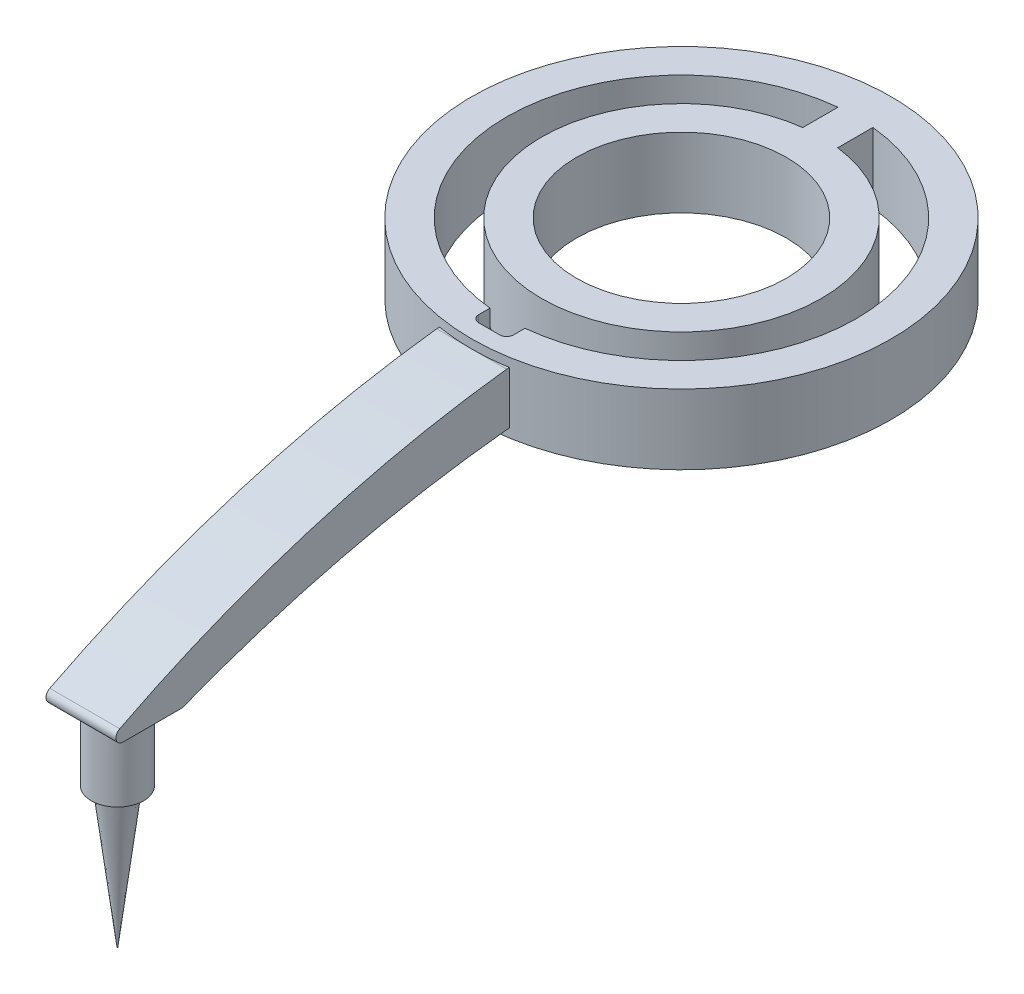
ISO-10303-21;
HEADER;
FILE_DESCRIPTION(('STEP AP214'),'2;1');
FILE_NAME('part.step','',(''),(''),'','','');
FILE_SCHEMA(('AUTOMOTIVE_DESIGN { 1 0 10303 214 1 1 1 1 }'));
ENDSEC;
DATA;
#1=APPLICATION_CONTEXT('core data for automotive mechanical design processes');
#2=APPLICATION_PROTOCOL_DEFINITION('international standard','automotive_design',2000,#1);
#3=PRODUCT_CONTEXT('',#1,'mechanical');
#4=PRODUCT('Part','Part','',(#3));
#5=PRODUCT_RELATED_PRODUCT_CATEGORY('part','',(#4));
#6=PRODUCT_DEFINITION_FORMATION('','',#4);
#7=PRODUCT_DEFINITION_CONTEXT('part definition',#1,'design');
#8=PRODUCT_DEFINITION('design','',#6,#7);
#9=PRODUCT_DEFINITION_SHAPE('','',#8);
#10=(LENGTH_UNIT() NAMED_UNIT(*) SI_UNIT(.MILLI.,.METRE.));
#11=(NAMED_UNIT(*) PLANE_ANGLE_UNIT() SI_UNIT($,.RADIAN.));
#12=(NAMED_UNIT(*) SI_UNIT($,.STERADIAN.) SOLID_ANGLE_UNIT());
#13=UNCERTAINTY_MEASURE_WITH_UNIT(LENGTH_MEASURE(1.E-05),#10,'distance_accuracy_value','');
#14=(GEOMETRIC_REPRESENTATION_CONTEXT(3) GLOBAL_UNCERTAINTY_ASSIGNED_CONTEXT((#13)) GLOBAL_UNIT_ASSIGNED_CONTEXT((#10,
#11,#12)) REPRESENTATION_CONTEXT('',''));
#15=CARTESIAN_POINT('',(0.,0.,0.));
#16=DIRECTION('',(0.,0.,1.));
#17=DIRECTION('',(1.,0.,0.));
#18=AXIS2_PLACEMENT_3D('',#15,#16,#17);
#19=CARTESIAN_POINT('',(0.,10.,0.));
#20=DIRECTION('',(0.,-1.,0.));
#21=DIRECTION('',(0.,0.,-1.));
#22=AXIS2_PLACEMENT_3D('',#19,#20,#21);
#23=CYLINDRICAL_SURFACE('',#22,25.);
#24=CARTESIAN_POINT('',(0.,0.,0.));
#25=DIRECTION('',(0.,1.,0.));
#26=DIRECTION('',(0.,0.,1.));
#27=AXIS2_PLACEMENT_3D('',#24,#25,#26);
#28=CIRCLE('',#27,25.);
#29=CARTESIAN_POINT('',(-2.5,0.,-24.8746859276655));
#30=VERTEX_POINT('',#29);
#31=CARTESIAN_POINT('',(-2.5,0.,24.8746859276655));
#32=VERTEX_POINT('',#31);
#33=EDGE_CURVE('E184',#30,#32,#28,.T.);
#34=ORIENTED_EDGE('',*,*,#33,.F.);
#35=DIRECTION('',(0.,-1.,0.));
#36=VECTOR('',#35,1.);
#37=CARTESIAN_POINT('',(-2.5,10.,-24.8746859276655));
#38=LINE('',#37,#36);
#39=CARTESIAN_POINT('',(-2.5,10.,-24.8746859276655));
#40=VERTEX_POINT('',#39);
#41=EDGE_CURVE('E272',#40,#30,#38,.T.);
#42=ORIENTED_EDGE('',*,*,#41,.F.);
#43=CARTESIAN_POINT('',(0.,10.,0.));
#44=DIRECTION('',(0.,1.,0.));
#45=DIRECTION('',(0.,0.,1.));
#46=AXIS2_PLACEMENT_3D('',#43,#44,#45);
#47=CIRCLE('',#46,25.);
#48=CARTESIAN_POINT('',(-2.5,10.,24.8746859276655));
#49=VERTEX_POINT('',#48);
#50=EDGE_CURVE('E194',#40,#49,#47,.T.);
#51=ORIENTED_EDGE('',*,*,#50,.T.);
#52=DIRECTION('',(0.,-1.,0.));
#53=VECTOR('',#52,1.);
#54=CARTESIAN_POINT('',(-2.5,10.,24.8746859276655));
#55=LINE('',#54,#53);
#56=EDGE_CURVE('E225',#49,#32,#55,.T.);
#57=ORIENTED_EDGE('',*,*,#56,.T.);
#58=EDGE_LOOP('',(#34,#42,#51,#57));
#59=FACE_BOUND('',#58,.T.);
#60=ADVANCED_FACE('F38',(#59),#23,.F.);
#61=CARTESIAN_POINT('',(-2.5,10.,0.));
#62=DIRECTION('',(1.,0.,0.));
#63=DIRECTION('',(0.,0.,-1.));
#64=AXIS2_PLACEMENT_3D('',#61,#62,#63);
#65=PLANE('',#64);
#66=DIRECTION('',(0.,0.,1.));
#67=VECTOR('',#66,1.);
#68=CARTESIAN_POINT('',(-2.5,0.,0.));
#69=LINE('',#68,#67);
#70=CARTESIAN_POINT('',(-2.5,0.,-19.8431348329844));
#71=VERTEX_POINT('',#70);
#72=EDGE_CURVE('E187',#30,#71,#69,.T.);
#73=ORIENTED_EDGE('',*,*,#72,.T.);
#74=DIRECTION('',(0.,-1.,0.));
#75=VECTOR('',#74,1.);
#76=CARTESIAN_POINT('',(-2.5,10.,-19.8431348329844));
#77=LINE('',#76,#75);
#78=CARTESIAN_POINT('',(-2.5,10.,-19.8431348329844));
#79=VERTEX_POINT('',#78);
#80=EDGE_CURVE('E269',#79,#71,#77,.T.);
#81=ORIENTED_EDGE('',*,*,#80,.F.);
#82=DIRECTION('',(0.,0.,1.));
#83=VECTOR('',#82,1.);
#84=CARTESIAN_POINT('',(-2.5,10.,0.));
#85=LINE('',#84,#83);
#86=EDGE_CURVE('E197',#40,#79,#85,.T.);
#87=ORIENTED_EDGE('',*,*,#86,.F.);
#88=ORIENTED_EDGE('',*,*,#41,.T.);
#89=EDGE_LOOP('',(#73,#81,#87,#88));
#90=FACE_BOUND('',#89,.T.);
#91=ADVANCED_FACE('F40',(#90),#65,.F.);
#92=CARTESIAN_POINT('',(0.,10.,0.));
#93=DIRECTION('',(0.,-1.,0.));
#94=DIRECTION('',(0.,0.,-1.));
#95=AXIS2_PLACEMENT_3D('',#92,#93,#94);
#96=CYLINDRICAL_SURFACE('',#95,20.);
#97=CARTESIAN_POINT('',(0.,0.,0.));
#98=DIRECTION('',(0.,1.,0.));
#99=DIRECTION('',(0.,0.,1.));
#100=AXIS2_PLACEMENT_3D('',#97,#98,#99);
#101=CIRCLE('',#100,20.);
#102=CARTESIAN_POINT('',(2.5,0.,-19.8431348329844));
#103=VERTEX_POINT('',#102);
#104=EDGE_CURVE('E228',#71,#103,#101,.T.);
#105=ORIENTED_EDGE('',*,*,#104,.T.);
#106=DIRECTION('',(0.,-1.,0.));
#107=VECTOR('',#106,1.);
#108=CARTESIAN_POINT('',(2.5,10.,-19.8431348329844));
#109=LINE('',#108,#107);
#110=CARTESIAN_POINT('',(2.5,10.,-19.8431348329844));
#111=VERTEX_POINT('',#110);
#112=EDGE_CURVE('E267',#111,#103,#109,.T.);
#113=ORIENTED_EDGE('',*,*,#112,.F.);
#114=CARTESIAN_POINT('',(0.,10.,0.));
#115=DIRECTION('',(0.,1.,0.));
#116=DIRECTION('',(0.,0.,1.));
#117=AXIS2_PLACEMENT_3D('',#114,#115,#116);
#118=CIRCLE('',#117,20.);
#119=EDGE_CURVE('E201',#79,#111,#118,.T.);
#120=ORIENTED_EDGE('',*,*,#119,.F.);
#121=ORIENTED_EDGE('',*,*,#80,.T.);
#122=EDGE_LOOP('',(#105,#113,#120,#121));
#123=FACE_BOUND('',#122,.T.);
#124=ADVANCED_FACE('F377',(#123),#96,.T.);
#125=CARTESIAN_POINT('',(2.5,10.,0.));
#126=DIRECTION('',(1.,0.,0.));
#127=DIRECTION('',(0.,0.,-1.));
#128=AXIS2_PLACEMENT_3D('',#125,#126,#127);
#129=PLANE('',#128);
#130=DIRECTION('',(0.,0.,1.));
#131=VECTOR('',#130,1.);
#132=CARTESIAN_POINT('',(2.5,0.,0.));
#133=LINE('',#132,#131);
#134=CARTESIAN_POINT('',(2.5,0.,-24.8746859276655));
#135=VERTEX_POINT('',#134);
#136=EDGE_CURVE('E231',#135,#103,#133,.T.);
#137=ORIENTED_EDGE('',*,*,#136,.F.);
#138=DIRECTION('',(0.,-1.,0.));
#139=VECTOR('',#138,1.);
#140=CARTESIAN_POINT('',(2.5,10.,-24.8746859276655));
#141=LINE('',#140,#139);
#142=CARTESIAN_POINT('',(2.5,10.,-24.8746859276655));
#143=VERTEX_POINT('',#142);
#144=EDGE_CURVE('E265',#143,#135,#141,.T.);
#145=ORIENTED_EDGE('',*,*,#144,.F.);
#146=DIRECTION('',(0.,0.,1.));
#147=VECTOR('',#146,1.);
#148=CARTESIAN_POINT('',(2.5,10.,0.));
#149=LINE('',#148,#147);
#150=EDGE_CURVE('E203',#143,#111,#149,.T.);
#151=ORIENTED_EDGE('',*,*,#150,.T.);
#152=ORIENTED_EDGE('',*,*,#112,.T.);
#153=EDGE_LOOP('',(#137,#145,#151,#152));
#154=FACE_BOUND('',#153,.T.);
#155=ADVANCED_FACE('F384',(#154),#129,.T.);
#156=CARTESIAN_POINT('',(2.5,0.,24.8746859276655));
#157=VERTEX_POINT('',#156);
#158=EDGE_CURVE('E189',#157,#135,#28,.T.);
#159=ORIENTED_EDGE('',*,*,#158,.F.);
#160=DIRECTION('',(0.,-1.,0.));
#161=VECTOR('',#160,1.);
#162=CARTESIAN_POINT('',(2.5,10.,24.8746859276655));
#163=LINE('',#162,#161);
#164=CARTESIAN_POINT('',(2.5,10.,24.8746859276655));
#165=VERTEX_POINT('',#164);
#166=EDGE_CURVE('E263',#165,#157,#163,.T.);
#167=ORIENTED_EDGE('',*,*,#166,.F.);
#168=EDGE_CURVE('E199',#165,#143,#47,.T.);
#169=ORIENTED_EDGE('',*,*,#168,.T.);
#170=ORIENTED_EDGE('',*,*,#144,.T.);
#171=EDGE_LOOP('',(#159,#167,#169,#170));
#172=FACE_BOUND('',#171,.T.);
#173=ADVANCED_FACE('F373',(#172),#23,.F.);
#174=CARTESIAN_POINT('',(2.5,10.,0.));
#175=DIRECTION('',(1.,0.,0.));
#176=DIRECTION('',(0.,0.,-1.));
#177=AXIS2_PLACEMENT_3D('',#174,#175,#176);
#178=PLANE('',#177);
#179=DIRECTION('',(0.,0.,1.));
#180=VECTOR('',#179,1.);
#181=CARTESIAN_POINT('',(2.5,0.,0.));
#182=LINE('',#181,#180);
#183=CARTESIAN_POINT('',(2.5,0.,26.5));
#184=VERTEX_POINT('',#183);
#185=EDGE_CURVE('E234',#157,#184,#182,.T.);
#186=ORIENTED_EDGE('',*,*,#185,.T.);
#187=DIRECTION('',(0.,-1.,0.));
#188=VECTOR('',#187,1.);
#189=CARTESIAN_POINT('',(2.5,10.,26.5));
#190=LINE('',#189,#188);
#191=CARTESIAN_POINT('',(2.5,10.,26.5));
#192=VERTEX_POINT('',#191);
#193=EDGE_CURVE('E261',#192,#184,#190,.T.);
#194=ORIENTED_EDGE('',*,*,#193,.F.);
#195=DIRECTION('',(0.,0.,1.));
#196=VECTOR('',#195,1.);
#197=CARTESIAN_POINT('',(2.5,10.,0.));
#198=LINE('',#197,#196);
#199=EDGE_CURVE('E206',#165,#192,#198,.T.);
#200=ORIENTED_EDGE('',*,*,#199,.F.);
#201=ORIENTED_EDGE('',*,*,#166,.T.);
#202=EDGE_LOOP('',(#186,#194,#200,#201));
#203=FACE_BOUND('',#202,.T.);
#204=ADVANCED_FACE('F383',(#203),#178,.F.);
#205=CARTESIAN_POINT('',(1.5,10.,26.5));
#206=DIRECTION('',(0.,-1.,0.));
#207=DIRECTION('',(0.,0.,-1.));
#208=AXIS2_PLACEMENT_3D('',#205,#206,#207);
#209=CYLINDRICAL_SURFACE('',#208,1.);
#210=CARTESIAN_POINT('',(1.5,0.,26.5));
#211=DIRECTION('',(0.,1.,0.));
#212=DIRECTION('',(0.,0.,1.));
#213=AXIS2_PLACEMENT_3D('',#210,#211,#212);
#214=CIRCLE('',#213,1.);
#215=CARTESIAN_POINT('',(1.5,0.,27.5));
#216=VERTEX_POINT('',#215);
#217=EDGE_CURVE('E237',#216,#184,#214,.T.);
#218=ORIENTED_EDGE('',*,*,#217,.F.);
#219=DIRECTION('',(0.,-1.,0.));
#220=VECTOR('',#219,1.);
#221=CARTESIAN_POINT('',(1.5,10.,27.5));
#222=LINE('',#221,#220);
#223=CARTESIAN_POINT('',(1.5,10.,27.5));
#224=VERTEX_POINT('',#223);
#225=EDGE_CURVE('E259',#224,#216,#222,.T.);
#226=ORIENTED_EDGE('',*,*,#225,.F.);
#227=CARTESIAN_POINT('',(1.5,10.,26.5));
#228=DIRECTION('',(0.,1.,0.));
#229=DIRECTION('',(0.,0.,1.));
#230=AXIS2_PLACEMENT_3D('',#227,#228,#229);
#231=CIRCLE('',#230,1.);
#232=EDGE_CURVE('E208',#224,#192,#231,.T.);
#233=ORIENTED_EDGE('',*,*,#232,.T.);
#234=ORIENTED_EDGE('',*,*,#193,.T.);
#235=EDGE_LOOP('',(#218,#226,#233,#234));
#236=FACE_BOUND('',#235,.T.);
#237=ADVANCED_FACE('F390',(#236),#209,.F.);
#238=CARTESIAN_POINT('',(0.,10.,27.5));
#239=DIRECTION('',(0.,0.,-1.));
#240=DIRECTION('',(-1.,0.,0.));
#241=AXIS2_PLACEMENT_3D('',#238,#239,#240);
#242=PLANE('',#241);
#243=ORIENTED_EDGE('',*,*,#225,.T.);
#244=DIRECTION('',(1.,0.,0.));
#245=VECTOR('',#244,1.);
#246=CARTESIAN_POINT('',(0.,0.,27.5));
#247=LINE('',#246,#245);
#248=CARTESIAN_POINT('',(-1.49999999999999,0.,27.5));
#249=VERTEX_POINT('',#248);
#250=EDGE_CURVE('E240',#249,#216,#247,.T.);
#251=ORIENTED_EDGE('',*,*,#250,.F.);
#252=DIRECTION('',(0.,-1.,0.));
#253=VECTOR('',#252,1.);
#254=CARTESIAN_POINT('',(-1.49999999999999,10.,27.5));
#255=LINE('',#254,#253);
#256=CARTESIAN_POINT('',(-1.49999999999999,10.,27.5));
#257=VERTEX_POINT('',#256);
#258=EDGE_CURVE('E257',#257,#249,#255,.T.);
#259=ORIENTED_EDGE('',*,*,#258,.F.);
#260=DIRECTION('',(1.,0.,0.));
#261=VECTOR('',#260,1.);
#262=CARTESIAN_POINT('',(0.,10.,27.5));
#263=LINE('',#262,#261);
#264=EDGE_CURVE('E211',#257,#224,#263,.T.);
#265=ORIENTED_EDGE('',*,*,#264,.T.);
#266=EDGE_LOOP('',(#243,#251,#259,#265));
#267=FACE_BOUND('',#266,.T.);
#268=ADVANCED_FACE('F429',(#267),#242,.T.);
#269=CARTESIAN_POINT('',(-1.5,10.,26.5));
#270=DIRECTION('',(0.,-1.,0.));
#271=DIRECTION('',(0.,0.,-1.));
#272=AXIS2_PLACEMENT_3D('',#269,#270,#271);
#273=CYLINDRICAL_SURFACE('',#272,1.);
#274=CARTESIAN_POINT('',(-1.5,0.,26.5));
#275=DIRECTION('',(0.,1.,0.));
#276=DIRECTION('',(0.,0.,1.));
#277=AXIS2_PLACEMENT_3D('',#274,#275,#276);
#278=CIRCLE('',#277,1.);
#279=CARTESIAN_POINT('',(-2.5,0.,26.5));
#280=VERTEX_POINT('',#279);
#281=EDGE_CURVE('E243',#280,#249,#278,.T.);
#282=ORIENTED_EDGE('',*,*,#281,.F.);
#283=DIRECTION('',(0.,-1.,0.));
#284=VECTOR('',#283,1.);
#285=CARTESIAN_POINT('',(-2.5,10.,26.5));
#286=LINE('',#285,#284);
#287=CARTESIAN_POINT('',(-2.5,10.,26.5));
#288=VERTEX_POINT('',#287);
#289=EDGE_CURVE('E255',#288,#280,#286,.T.);
#290=ORIENTED_EDGE('',*,*,#289,.F.);
#291=CARTESIAN_POINT('',(-1.5,10.,26.5));
#292=DIRECTION('',(0.,1.,0.));
#293=DIRECTION('',(0.,0.,1.));
#294=AXIS2_PLACEMENT_3D('',#291,#292,#293);
#295=CIRCLE('',#294,1.);
#296=EDGE_CURVE('E214',#288,#257,#295,.T.);
#297=ORIENTED_EDGE('',*,*,#296,.T.);
#298=ORIENTED_EDGE('',*,*,#258,.T.);
#299=EDGE_LOOP('',(#282,#290,#297,#298));
#300=FACE_BOUND('',#299,.T.);
#301=ADVANCED_FACE('F425',(#300),#273,.F.);
#302=CARTESIAN_POINT('',(0.,10.,0.));
#303=DIRECTION('',(0.,-1.,0.));
#304=DIRECTION('',(0.,0.,-1.));
#305=AXIS2_PLACEMENT_3D('',#302,#303,#304);
#306=CYLINDRICAL_SURFACE('',#305,15.);
#307=CARTESIAN_POINT('',(0.,10.,0.));
#308=DIRECTION('',(0.,1.,0.));
#309=DIRECTION('',(0.,0.,1.));
#310=AXIS2_PLACEMENT_3D('',#307,#308,#309);
#311=CIRCLE('',#310,15.);
#312=CARTESIAN_POINT('',(0.,10.,15.));
#313=VERTEX_POINT('',#312);
#314=EDGE_CURVE('E220',#313,#313,#311,.T.);
#315=ORIENTED_EDGE('',*,*,#314,.T.);
#316=EDGE_LOOP('',(#315));
#317=FACE_BOUND('',#316,.T.);
#318=CARTESIAN_POINT('',(0.,0.,0.));
#319=DIRECTION('',(0.,1.,0.));
#320=DIRECTION('',(0.,0.,1.));
#321=AXIS2_PLACEMENT_3D('',#318,#319,#320);
#322=CIRCLE('',#321,15.);
#323=CARTESIAN_POINT('',(0.,0.,15.));
#324=VERTEX_POINT('',#323);
#325=EDGE_CURVE('E249',#324,#324,#322,.T.);
#326=ORIENTED_EDGE('',*,*,#325,.F.);
#327=EDGE_LOOP('',(#326));
#328=FACE_BOUND('',#327,.T.);
#329=ADVANCED_FACE('F440',(#317,#328),#306,.F.);
#330=CARTESIAN_POINT('',(-2.5,10.,0.));
#331=DIRECTION('',(1.,0.,0.));
#332=DIRECTION('',(0.,0.,-1.));
#333=AXIS2_PLACEMENT_3D('',#330,#331,#332);
#334=PLANE('',#333);
#335=DIRECTION('',(0.,0.,1.));
#336=VECTOR('',#335,1.);
#337=CARTESIAN_POINT('',(-2.5,0.,0.));
#338=LINE('',#337,#336);
#339=EDGE_CURVE('E246',#32,#280,#338,.T.);
#340=ORIENTED_EDGE('',*,*,#339,.F.);
#341=ORIENTED_EDGE('',*,*,#56,.F.);
#342=DIRECTION('',(0.,0.,1.));
#343=VECTOR('',#342,1.);
#344=CARTESIAN_POINT('',(-2.5,10.,0.));
#345=LINE('',#344,#343);
#346=EDGE_CURVE('E217',#49,#288,#345,.T.);
#347=ORIENTED_EDGE('',*,*,#346,.T.);
#348=ORIENTED_EDGE('',*,*,#289,.T.);
#349=EDGE_LOOP('',(#340,#341,#347,#348));
#350=FACE_BOUND('',#349,.T.);
#351=ADVANCED_FACE('F421',(#350),#334,.T.);
#352=CARTESIAN_POINT('',(0.,10.,0.));
#353=DIRECTION('',(0.,-1.,0.));
#354=DIRECTION('',(0.,0.,-1.));
#355=AXIS2_PLACEMENT_3D('',#352,#353,#354);
#356=CYLINDRICAL_SURFACE('',#355,30.);
#357=CARTESIAN_POINT('',(0.,8.75,0.));
#358=DIRECTION('',(0.,-1.,0.));
#359=DIRECTION('',(0.,0.,-1.));
#360=AXIS2_PLACEMENT_3D('',#357,#358,#359);
#361=CIRCLE('',#360,30.);
#362=CARTESIAN_POINT('',(5.,8.75,29.5803989154981));
#363=VERTEX_POINT('',#362);
#364=CARTESIAN_POINT('',(0.,8.75,30.));
#365=VERTEX_POINT('',#364);
#366=EDGE_CURVE('E280',#363,#365,#361,.T.);
#367=ORIENTED_EDGE('',*,*,#366,.F.);
#368=DIRECTION('',(0.,-1.,0.));
#369=VECTOR('',#368,1.);
#370=CARTESIAN_POINT('',(5.,10.,29.5803989154981));
#371=LINE('',#370,#369);
#372=CARTESIAN_POINT('',(5.,1.25,29.5803989154981));
#373=VERTEX_POINT('',#372);
#374=EDGE_CURVE('E54',#363,#373,#371,.T.);
#375=ORIENTED_EDGE('',*,*,#374,.T.);
#376=CARTESIAN_POINT('',(0.,1.25,0.));
#377=DIRECTION('',(0.,1.,0.));
#378=DIRECTION('',(0.,0.,1.));
#379=AXIS2_PLACEMENT_3D('',#376,#377,#378);
#380=CIRCLE('',#379,30.);
#381=CARTESIAN_POINT('',(0.,1.25,30.));
#382=VERTEX_POINT('',#381);
#383=EDGE_CURVE('E58',#382,#373,#380,.T.);
#384=ORIENTED_EDGE('',*,*,#383,.F.);
#385=CARTESIAN_POINT('',(-5.,1.25,29.5803989154981));
#386=VERTEX_POINT('',#385);
#387=EDGE_CURVE('E281',#386,#382,#380,.T.);
#388=ORIENTED_EDGE('',*,*,#387,.F.);
#389=DIRECTION('',(0.,-1.,0.));
#390=VECTOR('',#389,1.);
#391=CARTESIAN_POINT('',(-5.,10.,29.5803989154981));
#392=LINE('',#391,#390);
#393=CARTESIAN_POINT('',(-5.,8.75,29.5803989154981));
#394=VERTEX_POINT('',#393);
#395=EDGE_CURVE('E274',#394,#386,#392,.T.);
#396=ORIENTED_EDGE('',*,*,#395,.F.);
#397=EDGE_CURVE('E277',#365,#394,#361,.T.);
#398=ORIENTED_EDGE('',*,*,#397,.F.);
#399=EDGE_LOOP('',(#367,#375,#384,#388,#396,#398));
#400=FACE_BOUND('',#399,.T.);
#401=CARTESIAN_POINT('',(0.,10.,0.));
#402=DIRECTION('',(0.,1.,0.));
#403=DIRECTION('',(0.,0.,1.));
#404=AXIS2_PLACEMENT_3D('',#401,#402,#403);
#405=CIRCLE('',#404,30.);
#406=CARTESIAN_POINT('',(0.,10.,30.));
#407=VERTEX_POINT('',#406);
#408=EDGE_CURVE('E223',#407,#407,#405,.T.);
#409=ORIENTED_EDGE('',*,*,#408,.F.);
#410=EDGE_LOOP('',(#409));
#411=FACE_BOUND('',#410,.T.);
#412=CARTESIAN_POINT('',(0.,0.,0.));
#413=DIRECTION('',(0.,1.,0.));
#414=DIRECTION('',(0.,0.,1.));
#415=AXIS2_PLACEMENT_3D('',#412,#413,#414);
#416=CIRCLE('',#415,30.);
#417=CARTESIAN_POINT('',(0.,0.,30.));
#418=VERTEX_POINT('',#417);
#419=EDGE_CURVE('E198',#418,#418,#416,.T.);
#420=ORIENTED_EDGE('',*,*,#419,.T.);
#421=EDGE_LOOP('',(#420));
#422=FACE_BOUND('',#421,.T.);
#423=ADVANCED_FACE('F443',(#400,#411,#422),#356,.T.);
#424=CARTESIAN_POINT('',(0.,10.,0.));
#425=DIRECTION('',(0.,1.,0.));
#426=DIRECTION('',(0.,0.,1.));
#427=AXIS2_PLACEMENT_3D('',#424,#425,#426);
#428=PLANE('',#427);
#429=ORIENTED_EDGE('',*,*,#50,.F.);
#430=ORIENTED_EDGE('',*,*,#86,.T.);
#431=ORIENTED_EDGE('',*,*,#119,.T.);
#432=ORIENTED_EDGE('',*,*,#150,.F.);
#433=ORIENTED_EDGE('',*,*,#168,.F.);
#434=ORIENTED_EDGE('',*,*,#199,.T.);
#435=ORIENTED_EDGE('',*,*,#232,.F.);
#436=ORIENTED_EDGE('',*,*,#264,.F.);
#437=ORIENTED_EDGE('',*,*,#296,.F.);
#438=ORIENTED_EDGE('',*,*,#346,.F.);
#439=EDGE_LOOP('',(#429,#430,#431,#432,#433,#434,#435,#436,#437,#438));
#440=FACE_BOUND('',#439,.T.);
#441=ORIENTED_EDGE('',*,*,#314,.F.);
#442=EDGE_LOOP('',(#441));
#443=FACE_BOUND('',#442,.T.);
#444=ORIENTED_EDGE('',*,*,#408,.T.);
#445=EDGE_LOOP('',(#444));
#446=FACE_BOUND('',#445,.T.);
#447=ADVANCED_FACE('F410',(#440,#443,#446),#428,.T.);
#448=CARTESIAN_POINT('',(0.,0.,0.));
#449=DIRECTION('',(0.,1.,0.));
#450=DIRECTION('',(0.,0.,1.));
#451=AXIS2_PLACEMENT_3D('',#448,#449,#450);
#452=PLANE('',#451);
#453=ORIENTED_EDGE('',*,*,#33,.T.);
#454=ORIENTED_EDGE('',*,*,#339,.T.);
#455=ORIENTED_EDGE('',*,*,#281,.T.);
#456=ORIENTED_EDGE('',*,*,#250,.T.);
#457=ORIENTED_EDGE('',*,*,#217,.T.);
#458=ORIENTED_EDGE('',*,*,#185,.F.);
#459=ORIENTED_EDGE('',*,*,#158,.T.);
#460=ORIENTED_EDGE('',*,*,#136,.T.);
#461=ORIENTED_EDGE('',*,*,#104,.F.);
#462=ORIENTED_EDGE('',*,*,#72,.F.);
#463=EDGE_LOOP('',(#453,#454,#455,#456,#457,#458,#459,#460,#461,#462));
#464=FACE_BOUND('',#463,.T.);
#465=ORIENTED_EDGE('',*,*,#325,.T.);
#466=EDGE_LOOP('',(#465));
#467=FACE_BOUND('',#466,.T.);
#468=ORIENTED_EDGE('',*,*,#419,.F.);
#469=EDGE_LOOP('',(#468));
#470=FACE_BOUND('',#469,.T.);
#471=ADVANCED_FACE('F400',(#464,#467,#470),#452,.F.);
#472=CARTESIAN_POINT('',(5.,1.25,30.));
#473=DIRECTION('',(0.,1.,0.));
#474=DIRECTION('',(0.,0.,1.));
#475=AXIS2_PLACEMENT_3D('',#472,#473,#474);
#476=PLANE('',#475);
#477=DIRECTION('',(-1.,0.,0.));
#478=VECTOR('',#477,1.);
#479=CARTESIAN_POINT('',(5.,1.25,30.));
#480=LINE('',#479,#478);
#481=CARTESIAN_POINT('',(5.,1.25,30.));
#482=VERTEX_POINT('',#481);
#483=EDGE_CURVE('E166',#482,#382,#480,.T.);
#484=ORIENTED_EDGE('',*,*,#483,.T.);
#485=ORIENTED_EDGE('',*,*,#383,.T.);
#486=DIRECTION('',(0.,0.,-1.));
#487=VECTOR('',#486,1.);
#488=CARTESIAN_POINT('',(5.,1.25,30.));
#489=LINE('',#488,#487);
#490=EDGE_CURVE('E162',#482,#373,#489,.T.);
#491=ORIENTED_EDGE('',*,*,#490,.F.);
#492=EDGE_LOOP('',(#484,#485,#491));
#493=FACE_BOUND('',#492,.T.);
#494=ADVANCED_FACE('F164',(#493),#476,.F.);
#495=CARTESIAN_POINT('',(5.,8.75,30.));
#496=DIRECTION('',(0.,-1.,0.));
#497=DIRECTION('',(0.,0.,-1.));
#498=AXIS2_PLACEMENT_3D('',#495,#496,#497);
#499=PLANE('',#498);
#500=DIRECTION('',(0.,0.,1.));
#501=VECTOR('',#500,1.);
#502=CARTESIAN_POINT('',(5.,8.75,30.));
#503=LINE('',#502,#501);
#504=CARTESIAN_POINT('',(5.,8.75,30.));
#505=VERTEX_POINT('',#504);
#506=EDGE_CURVE('E168',#363,#505,#503,.T.);
#507=ORIENTED_EDGE('',*,*,#506,.F.);
#508=ORIENTED_EDGE('',*,*,#366,.T.);
#509=DIRECTION('',(-1.,0.,0.));
#510=VECTOR('',#509,1.);
#511=CARTESIAN_POINT('',(5.,8.75,30.));
#512=LINE('',#511,#510);
#513=EDGE_CURVE('E190',#505,#365,#512,.T.);
#514=ORIENTED_EDGE('',*,*,#513,.F.);
#515=EDGE_LOOP('',(#507,#508,#514));
#516=FACE_BOUND('',#515,.T.);
#517=ADVANCED_FACE('F340',(#516),#499,.F.);
#518=CARTESIAN_POINT('',(5.,-175.652083317353,11.6726899284434));
#519=DIRECTION('',(1.,0.,0.));
#520=DIRECTION('',(0.,0.,-1.));
#521=AXIS2_PLACEMENT_3D('',#518,#519,#520);
#522=PLANE('',#521);
#523=ORIENTED_EDGE('',*,*,#374,.F.);
#524=ORIENTED_EDGE('',*,*,#506,.T.);
#525=CARTESIAN_POINT('',(5.,-154.068707946287,10.6033187777101));
#526=DIRECTION('',(1.,0.,0.));
#527=DIRECTION('',(0.,0.,-1.));
#528=AXIS2_PLACEMENT_3D('',#525,#526,#527);
#529=CIRCLE('',#528,163.970006097875);
#530=CARTESIAN_POINT('',(5.,-8.10984412764174,85.3172597292326));
#531=VERTEX_POINT('',#530);
#532=EDGE_CURVE('E336',#505,#531,#529,.T.);
#533=ORIENTED_EDGE('',*,*,#532,.T.);
#534=CARTESIAN_POINT('',(5.,-9.00000000000001,84.861603583761));
#535=DIRECTION('',(1.,0.,0.));
#536=DIRECTION('',(0.,0.,-1.));
#537=AXIS2_PLACEMENT_3D('',#534,#535,#536);
#538=CIRCLE('',#537,1.);
#539=CARTESIAN_POINT('',(5.,-10.,84.861603583761));
#540=VERTEX_POINT('',#539);
#541=EDGE_CURVE('E344',#531,#540,#538,.T.);
#542=ORIENTED_EDGE('',*,*,#541,.T.);
#543=DIRECTION('',(0.,0.,-1.));
#544=VECTOR('',#543,1.);
#545=CARTESIAN_POINT('',(5.,-10.,84.861603583761));
#546=LINE('',#545,#544);
#547=CARTESIAN_POINT('',(5.,-10.,76.4));
#548=VERTEX_POINT('',#547);
#549=EDGE_CURVE('E174',#540,#548,#546,.T.);
#550=ORIENTED_EDGE('',*,*,#549,.T.);
#551=CARTESIAN_POINT('',(5.,-175.652083317353,11.6726899284434));
#552=DIRECTION('',(-1.,0.,0.));
#553=DIRECTION('',(0.,0.,-1.));
#554=AXIS2_PLACEMENT_3D('',#551,#552,#553);
#555=CIRCLE('',#554,177.848917276656);
#556=EDGE_CURVE('E169',#548,#482,#555,.T.);
#557=ORIENTED_EDGE('',*,*,#556,.T.);
#558=ORIENTED_EDGE('',*,*,#490,.T.);
#559=EDGE_LOOP('',(#523,#524,#533,#542,#550,#557,#558));
#560=FACE_BOUND('',#559,.T.);
#561=ADVANCED_FACE('F172',(#560),#522,.T.);
#562=CARTESIAN_POINT('',(-5.,-175.652083317353,11.6726899284434));
#563=DIRECTION('',(1.,0.,0.));
#564=DIRECTION('',(0.,0.,-1.));
#565=AXIS2_PLACEMENT_3D('',#562,#563,#564);
#566=PLANE('',#565);
#567=DIRECTION('',(0.,0.,1.));
#568=VECTOR('',#567,1.);
#569=CARTESIAN_POINT('',(-5.,8.75,30.));
#570=LINE('',#569,#568);
#571=CARTESIAN_POINT('',(-5.,8.75,30.));
#572=VERTEX_POINT('',#571);
#573=EDGE_CURVE('E311',#394,#572,#570,.T.);
#574=ORIENTED_EDGE('',*,*,#573,.F.);
#575=ORIENTED_EDGE('',*,*,#395,.T.);
#576=DIRECTION('',(0.,0.,-1.));
#577=VECTOR('',#576,1.);
#578=CARTESIAN_POINT('',(-5.,1.25,30.));
#579=LINE('',#578,#577);
#580=CARTESIAN_POINT('',(-5.,1.25,30.));
#581=VERTEX_POINT('',#580);
#582=EDGE_CURVE('E308',#581,#386,#579,.T.);
#583=ORIENTED_EDGE('',*,*,#582,.F.);
#584=CARTESIAN_POINT('',(-5.,-175.652083317353,11.6726899284434));
#585=DIRECTION('',(-1.,0.,0.));
#586=DIRECTION('',(0.,0.,-1.));
#587=AXIS2_PLACEMENT_3D('',#584,#585,#586);
#588=CIRCLE('',#587,177.848917276656);
#589=CARTESIAN_POINT('',(-5.,-10.,76.4));
#590=VERTEX_POINT('',#589);
#591=EDGE_CURVE('E302',#590,#581,#588,.T.);
#592=ORIENTED_EDGE('',*,*,#591,.F.);
#593=DIRECTION('',(0.,0.,-1.));
#594=VECTOR('',#593,1.);
#595=CARTESIAN_POINT('',(-5.,-10.,84.861603583761));
#596=LINE('',#595,#594);
#597=CARTESIAN_POINT('',(-5.,-10.,84.861603583761));
#598=VERTEX_POINT('',#597);
#599=EDGE_CURVE('E178',#598,#590,#596,.T.);
#600=ORIENTED_EDGE('',*,*,#599,.F.);
#601=CARTESIAN_POINT('',(-5.,-9.00000000000001,84.861603583761));
#602=DIRECTION('',(1.,0.,0.));
#603=DIRECTION('',(0.,0.,-1.));
#604=AXIS2_PLACEMENT_3D('',#601,#602,#603);
#605=CIRCLE('',#604,1.);
#606=CARTESIAN_POINT('',(-5.,-8.10984412764174,85.3172597292326));
#607=VERTEX_POINT('',#606);
#608=EDGE_CURVE('E300',#607,#598,#605,.T.);
#609=ORIENTED_EDGE('',*,*,#608,.F.);
#610=CARTESIAN_POINT('',(-5.,-154.068707946287,10.6033187777101));
#611=DIRECTION('',(1.,0.,0.));
#612=DIRECTION('',(0.,0.,-1.));
#613=AXIS2_PLACEMENT_3D('',#610,#611,#612);
#614=CIRCLE('',#613,163.970006097875);
#615=EDGE_CURVE('E321',#572,#607,#614,.T.);
#616=ORIENTED_EDGE('',*,*,#615,.F.);
#617=EDGE_LOOP('',(#574,#575,#583,#592,#600,#609,#616));
#618=FACE_BOUND('',#617,.T.);
#619=ADVANCED_FACE('F306',(#618),#566,.F.);
#620=CARTESIAN_POINT('',(5.,-175.652083317353,11.6726899284434));
#621=DIRECTION('',(-1.,0.,0.));
#622=DIRECTION('',(0.,0.,1.));
#623=AXIS2_PLACEMENT_3D('',#620,#621,#622);
#624=CYLINDRICAL_SURFACE('',#623,177.848917276656);
#625=ORIENTED_EDGE('',*,*,#591,.T.);
#626=EDGE_CURVE('E183',#382,#581,#480,.T.);
#627=ORIENTED_EDGE('',*,*,#626,.F.);
#628=ORIENTED_EDGE('',*,*,#483,.F.);
#629=ORIENTED_EDGE('',*,*,#556,.F.);
#630=DIRECTION('',(-1.,0.,0.));
#631=VECTOR('',#630,1.);
#632=CARTESIAN_POINT('',(5.,-10.,76.4));
#633=LINE('',#632,#631);
#634=EDGE_CURVE('E294',#548,#590,#633,.T.);
#635=ORIENTED_EDGE('',*,*,#634,.T.);
#636=EDGE_LOOP('',(#625,#627,#628,#629,#635));
#637=FACE_BOUND('',#636,.T.);
#638=ADVANCED_FACE('F182',(#637),#624,.F.);
#639=ORIENTED_EDGE('',*,*,#582,.T.);
#640=ORIENTED_EDGE('',*,*,#387,.T.);
#641=ORIENTED_EDGE('',*,*,#626,.T.);
#642=EDGE_LOOP('',(#639,#640,#641));
#643=FACE_BOUND('',#642,.T.);
#644=ADVANCED_FACE('F455',(#643),#476,.F.);
#645=EDGE_CURVE('E326',#365,#572,#512,.T.);
#646=ORIENTED_EDGE('',*,*,#645,.F.);
#647=ORIENTED_EDGE('',*,*,#397,.T.);
#648=ORIENTED_EDGE('',*,*,#573,.T.);
#649=EDGE_LOOP('',(#646,#647,#648));
#650=FACE_BOUND('',#649,.T.);
#651=ADVANCED_FACE('F342',(#650),#499,.F.);
#652=CARTESIAN_POINT('',(5.,-154.068707946287,10.6033187777101));
#653=DIRECTION('',(-1.,0.,0.));
#654=DIRECTION('',(0.,0.,1.));
#655=AXIS2_PLACEMENT_3D('',#652,#653,#654);
#656=CYLINDRICAL_SURFACE('',#655,163.970006097875);
#657=ORIENTED_EDGE('',*,*,#615,.T.);
#658=DIRECTION('',(-1.,0.,0.));
#659=VECTOR('',#658,1.);
#660=CARTESIAN_POINT('',(5.,-8.10984412764174,85.3172597292326));
#661=LINE('',#660,#659);
#662=EDGE_CURVE('E324',#531,#607,#661,.T.);
#663=ORIENTED_EDGE('',*,*,#662,.F.);
#664=ORIENTED_EDGE('',*,*,#532,.F.);
#665=ORIENTED_EDGE('',*,*,#513,.T.);
#666=ORIENTED_EDGE('',*,*,#645,.T.);
#667=EDGE_LOOP('',(#657,#663,#664,#665,#666));
#668=FACE_BOUND('',#667,.T.);
#669=ADVANCED_FACE('F335',(#668),#656,.T.);
#670=CARTESIAN_POINT('',(5.,-9.00000000000001,84.861603583761));
#671=DIRECTION('',(-1.,0.,0.));
#672=DIRECTION('',(0.,0.,1.));
#673=AXIS2_PLACEMENT_3D('',#670,#671,#672);
#674=CYLINDRICAL_SURFACE('',#673,1.);
#675=ORIENTED_EDGE('',*,*,#608,.T.);
#676=DIRECTION('',(-1.,0.,0.));
#677=VECTOR('',#676,1.);
#678=CARTESIAN_POINT('',(5.,-10.,84.861603583761));
#679=LINE('',#678,#677);
#680=EDGE_CURVE('E296',#540,#598,#679,.T.);
#681=ORIENTED_EDGE('',*,*,#680,.F.);
#682=ORIENTED_EDGE('',*,*,#541,.F.);
#683=ORIENTED_EDGE('',*,*,#662,.T.);
#684=EDGE_LOOP('',(#675,#681,#682,#683));
#685=FACE_BOUND('',#684,.T.);
#686=ADVANCED_FACE('F290',(#685),#674,.T.);
#687=CARTESIAN_POINT('',(5.,-10.,84.861603583761));
#688=DIRECTION('',(0.,1.,0.));
#689=DIRECTION('',(0.,0.,1.));
#690=AXIS2_PLACEMENT_3D('',#687,#688,#689);
#691=PLANE('',#690);
#692=CARTESIAN_POINT('',(0.,-10.,80.65));
#693=DIRECTION('',(0.,1.,0.));
#694=DIRECTION('',(0.,0.,1.));
#695=AXIS2_PLACEMENT_3D('',#692,#693,#694);
#696=CIRCLE('',#695,3.75);
#697=CARTESIAN_POINT('',(0.,-10.,84.4));
#698=VERTEX_POINT('',#697);
#699=EDGE_CURVE('E42',#698,#698,#696,.F.);
#700=ORIENTED_EDGE('',*,*,#699,.F.);
#701=EDGE_LOOP('',(#700));
#702=FACE_BOUND('',#701,.T.);
#703=ORIENTED_EDGE('',*,*,#599,.T.);
#704=ORIENTED_EDGE('',*,*,#634,.F.);
#705=ORIENTED_EDGE('',*,*,#549,.F.);
#706=ORIENTED_EDGE('',*,*,#680,.T.);
#707=EDGE_LOOP('',(#703,#704,#705,#706));
#708=FACE_BOUND('',#707,.T.);
#709=ADVANCED_FACE('F287',(#702,#708),#691,.F.);
#710=CARTESIAN_POINT('',(0.,-20.,80.65));
#711=DIRECTION('',(0.,1.,0.));
#712=DIRECTION('',(0.,0.,1.));
#713=AXIS2_PLACEMENT_3D('',#710,#711,#712);
#714=CYLINDRICAL_SURFACE('',#713,3.75);
#715=CARTESIAN_POINT('',(0.,-20.,80.65));
#716=DIRECTION('',(0.,-1.,0.));
#717=DIRECTION('',(0.,0.,-1.));
#718=AXIS2_PLACEMENT_3D('',#715,#716,#717);
#719=CIRCLE('',#718,3.75);
#720=CARTESIAN_POINT('',(0.,-20.,76.9));
#721=VERTEX_POINT('',#720);
#722=EDGE_CURVE('E309',#721,#721,#719,.T.);
#723=ORIENTED_EDGE('',*,*,#722,.F.);
#724=EDGE_LOOP('',(#723));
#725=FACE_BOUND('',#724,.T.);
#726=ORIENTED_EDGE('',*,*,#699,.T.);
#727=EDGE_LOOP('',(#726));
#728=FACE_BOUND('',#727,.T.);
#729=ADVANCED_FACE('F285',(#725,#728),#714,.T.);
#730=CARTESIAN_POINT('',(0.,-20.,80.65));
#731=DIRECTION('',(0.,-1.,0.));
#732=DIRECTION('',(0.,0.,-1.));
#733=AXIS2_PLACEMENT_3D('',#730,#731,#732);
#734=PLANE('',#733);
#735=CARTESIAN_POINT('',(0.,-20.,80.65));
#736=DIRECTION('',(0.,-1.,0.));
#737=DIRECTION('',(0.,0.,-1.));
#738=AXIS2_PLACEMENT_3D('',#735,#736,#737);
#739=CIRCLE('',#738,2.5);
#740=CARTESIAN_POINT('',(0.,-20.,78.15));
#741=VERTEX_POINT('',#740);
#742=EDGE_CURVE('E11',#741,#741,#739,.T.);
#743=ORIENTED_EDGE('',*,*,#742,.F.);
#744=EDGE_LOOP('',(#743));
#745=FACE_BOUND('',#744,.T.);
#746=ORIENTED_EDGE('',*,*,#722,.T.);
#747=EDGE_LOOP('',(#746));
#748=FACE_BOUND('',#747,.T.);
#749=ADVANCED_FACE('F356',(#745,#748),#734,.T.);
#750=CARTESIAN_POINT('',(0.,-20.,80.65));
#751=DIRECTION('',(0.,1.,0.));
#752=DIRECTION('',(0.,0.,-1.));
#753=AXIS2_PLACEMENT_3D('',#750,#751,#752);
#754=CONICAL_SURFACE('',#753,2.5,0.122173047639603);
#755=CARTESIAN_POINT('',(0.,-40.,80.65));
#756=DIRECTION('',(0.,-1.,0.));
#757=DIRECTION('',(0.,0.,-1.));
#758=AXIS2_PLACEMENT_3D('',#755,#756,#757);
#759=CIRCLE('',#758,0.0443087819419055);
#760=CARTESIAN_POINT('',(0.,-40.,80.6056912180581));
#761=VERTEX_POINT('',#760);
#762=EDGE_CURVE('E314',#761,#761,#759,.T.);
#763=ORIENTED_EDGE('',*,*,#762,.F.);
#764=EDGE_LOOP('',(#763));
#765=FACE_BOUND('',#764,.T.);
#766=ORIENTED_EDGE('',*,*,#742,.T.);
#767=EDGE_LOOP('',(#766));
#768=FACE_BOUND('',#767,.T.);
#769=ADVANCED_FACE('F353',(#765,#768),#754,.T.);
#770=CARTESIAN_POINT('',(0.,-40.,80.65));
#771=DIRECTION('',(0.,-1.,0.));
#772=DIRECTION('',(0.,0.,-1.));
#773=AXIS2_PLACEMENT_3D('',#770,#771,#772);
#774=PLANE('',#773);
#775=ORIENTED_EDGE('',*,*,#762,.T.);
#776=EDGE_LOOP('',(#775));
#777=FACE_BOUND('',#776,.T.);
#778=ADVANCED_FACE('F351',(#777),#774,.T.);
#779=CLOSED_SHELL('',(#60,#91,#124,#155,#173,#204,#237,#268,#301,#329,#351,#423,#447,#471,#494,
#517,#561,#619,#638,#644,#651,#669,#686,#709,#729,#749,#769,#778));
#780=MANIFOLD_SOLID_BREP('B2',#779);
#781=ADVANCED_BREP_SHAPE_REPRESENTATION('',(#18,#780),#14);
#782=SHAPE_DEFINITION_REPRESENTATION(#9,#781);
ENDSEC;
END-ISO-10303-21;
